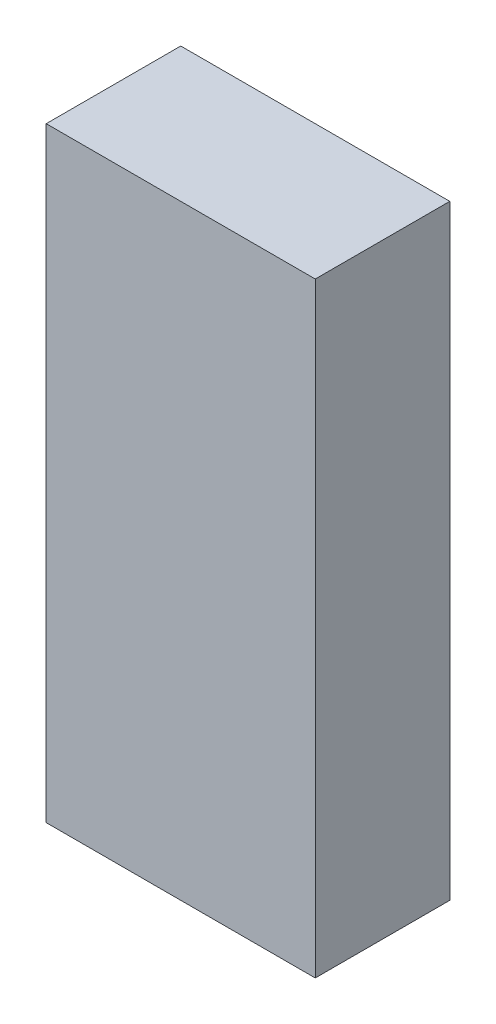
ISO-10303-21;
HEADER;
FILE_DESCRIPTION(('STEP AP214'),'2;1');
FILE_NAME('part.step','',(''),(''),'','','');
FILE_SCHEMA(('AUTOMOTIVE_DESIGN { 1 0 10303 214 1 1 1 1 }'));
ENDSEC;
DATA;
#1=APPLICATION_CONTEXT('core data for automotive mechanical design processes');
#2=APPLICATION_PROTOCOL_DEFINITION('international standard','automotive_design',2000,#1);
#3=PRODUCT_CONTEXT('',#1,'mechanical');
#4=PRODUCT('Part','Part','',(#3));
#5=PRODUCT_RELATED_PRODUCT_CATEGORY('part','',(#4));
#6=PRODUCT_DEFINITION_FORMATION('','',#4);
#7=PRODUCT_DEFINITION_CONTEXT('part definition',#1,'design');
#8=PRODUCT_DEFINITION('design','',#6,#7);
#9=PRODUCT_DEFINITION_SHAPE('','',#8);
#10=(LENGTH_UNIT() NAMED_UNIT(*) SI_UNIT(.MILLI.,.METRE.));
#11=(NAMED_UNIT(*) PLANE_ANGLE_UNIT() SI_UNIT($,.RADIAN.));
#12=(NAMED_UNIT(*) SI_UNIT($,.STERADIAN.) SOLID_ANGLE_UNIT());
#13=UNCERTAINTY_MEASURE_WITH_UNIT(LENGTH_MEASURE(1.E-05),#10,'distance_accuracy_value','');
#14=(GEOMETRIC_REPRESENTATION_CONTEXT(3) GLOBAL_UNCERTAINTY_ASSIGNED_CONTEXT((#13)) GLOBAL_UNIT_ASSIGNED_CONTEXT((#10,
#11,#12)) REPRESENTATION_CONTEXT('',''));
#15=CARTESIAN_POINT('',(0.,0.,0.));
#16=DIRECTION('',(0.,0.,1.));
#17=DIRECTION('',(1.,0.,0.));
#18=AXIS2_PLACEMENT_3D('',#15,#16,#17);
#19=CARTESIAN_POINT('',(-0.1,-2.975,0.));
#20=DIRECTION('',(1.,0.,0.));
#21=DIRECTION('',(0.,0.,1.));
#22=AXIS2_PLACEMENT_3D('',#19,#20,#21);
#23=PLANE('',#22);
#24=DIRECTION('',(0.,1.,0.));
#25=VECTOR('',#24,1.);
#26=CARTESIAN_POINT('',(-0.1,-2.975,0.1));
#27=LINE('',#26,#25);
#28=CARTESIAN_POINT('',(-0.1,-2.975,0.1));
#29=VERTEX_POINT('',#28);
#30=CARTESIAN_POINT('',(-0.1,-2.525,0.1));
#31=VERTEX_POINT('',#30);
#32=EDGE_CURVE('E11',#29,#31,#27,.T.);
#33=ORIENTED_EDGE('',*,*,#32,.T.);
#34=DIRECTION('',(0.,0.,1.));
#35=VECTOR('',#34,1.);
#36=CARTESIAN_POINT('',(-0.1,-2.525,0.));
#37=LINE('',#36,#35);
#38=CARTESIAN_POINT('',(-0.1,-2.525,0.));
#39=VERTEX_POINT('',#38);
#40=EDGE_CURVE('E24',#39,#31,#37,.T.);
#41=ORIENTED_EDGE('',*,*,#40,.F.);
#42=DIRECTION('',(0.,1.,0.));
#43=VECTOR('',#42,1.);
#44=CARTESIAN_POINT('',(-0.1,-2.975,0.));
#45=LINE('',#44,#43);
#46=CARTESIAN_POINT('',(-0.1,-2.975,0.));
#47=VERTEX_POINT('',#46);
#48=EDGE_CURVE('E86',#47,#39,#45,.T.);
#49=ORIENTED_EDGE('',*,*,#48,.F.);
#50=DIRECTION('',(0.,0.,1.));
#51=VECTOR('',#50,1.);
#52=CARTESIAN_POINT('',(-0.1,-2.975,0.));
#53=LINE('',#52,#51);
#54=EDGE_CURVE('E36',#47,#29,#53,.T.);
#55=ORIENTED_EDGE('',*,*,#54,.T.);
#56=EDGE_LOOP('',(#33,#41,#49,#55));
#57=FACE_BOUND('',#56,.T.);
#58=ADVANCED_FACE('F17',(#57),#23,.F.);
#59=CARTESIAN_POINT('',(0.1,-2.975,0.));
#60=DIRECTION('',(1.,0.,0.));
#61=DIRECTION('',(0.,0.,1.));
#62=AXIS2_PLACEMENT_3D('',#59,#60,#61);
#63=PLANE('',#62);
#64=DIRECTION('',(0.,0.,1.));
#65=VECTOR('',#64,1.);
#66=CARTESIAN_POINT('',(0.1,-2.975,0.));
#67=LINE('',#66,#65);
#68=CARTESIAN_POINT('',(0.1,-2.975,0.));
#69=VERTEX_POINT('',#68);
#70=CARTESIAN_POINT('',(0.1,-2.975,0.1));
#71=VERTEX_POINT('',#70);
#72=EDGE_CURVE('E83',#69,#71,#67,.T.);
#73=ORIENTED_EDGE('',*,*,#72,.F.);
#74=DIRECTION('',(0.,1.,0.));
#75=VECTOR('',#74,1.);
#76=CARTESIAN_POINT('',(0.1,-2.975,0.));
#77=LINE('',#76,#75);
#78=CARTESIAN_POINT('',(0.1,-2.525,0.));
#79=VERTEX_POINT('',#78);
#80=EDGE_CURVE('E63',#69,#79,#77,.T.);
#81=ORIENTED_EDGE('',*,*,#80,.T.);
#82=DIRECTION('',(0.,0.,1.));
#83=VECTOR('',#82,1.);
#84=CARTESIAN_POINT('',(0.1,-2.525,0.));
#85=LINE('',#84,#83);
#86=CARTESIAN_POINT('',(0.1,-2.525,0.1));
#87=VERTEX_POINT('',#86);
#88=EDGE_CURVE('E57',#79,#87,#85,.T.);
#89=ORIENTED_EDGE('',*,*,#88,.T.);
#90=DIRECTION('',(0.,1.,0.));
#91=VECTOR('',#90,1.);
#92=CARTESIAN_POINT('',(0.1,-2.975,0.1));
#93=LINE('',#92,#91);
#94=EDGE_CURVE('E60',#71,#87,#93,.T.);
#95=ORIENTED_EDGE('',*,*,#94,.F.);
#96=EDGE_LOOP('',(#73,#81,#89,#95));
#97=FACE_BOUND('',#96,.T.);
#98=ADVANCED_FACE('F59',(#97),#63,.T.);
#99=CARTESIAN_POINT('',(-0.1,-2.975,0.));
#100=DIRECTION('',(0.,1.,0.));
#101=DIRECTION('',(0.,0.,1.));
#102=AXIS2_PLACEMENT_3D('',#99,#100,#101);
#103=PLANE('',#102);
#104=ORIENTED_EDGE('',*,*,#72,.T.);
#105=DIRECTION('',(1.,0.,0.));
#106=VECTOR('',#105,1.);
#107=CARTESIAN_POINT('',(-0.1,-2.975,0.1));
#108=LINE('',#107,#106);
#109=EDGE_CURVE('E71',#29,#71,#108,.T.);
#110=ORIENTED_EDGE('',*,*,#109,.F.);
#111=ORIENTED_EDGE('',*,*,#54,.F.);
#112=DIRECTION('',(1.,0.,0.));
#113=VECTOR('',#112,1.);
#114=CARTESIAN_POINT('',(-0.1,-2.975,0.));
#115=LINE('',#114,#113);
#116=EDGE_CURVE('E76',#47,#69,#115,.T.);
#117=ORIENTED_EDGE('',*,*,#116,.T.);
#118=EDGE_LOOP('',(#104,#110,#111,#117));
#119=FACE_BOUND('',#118,.T.);
#120=ADVANCED_FACE('F91',(#119),#103,.F.);
#121=CARTESIAN_POINT('',(-0.1,-2.525,0.));
#122=DIRECTION('',(0.,1.,0.));
#123=DIRECTION('',(0.,0.,1.));
#124=AXIS2_PLACEMENT_3D('',#121,#122,#123);
#125=PLANE('',#124);
#126=DIRECTION('',(1.,0.,0.));
#127=VECTOR('',#126,1.);
#128=CARTESIAN_POINT('',(-0.1,-2.525,0.));
#129=LINE('',#128,#127);
#130=EDGE_CURVE('E74',#39,#79,#129,.T.);
#131=ORIENTED_EDGE('',*,*,#130,.F.);
#132=ORIENTED_EDGE('',*,*,#40,.T.);
#133=DIRECTION('',(1.,0.,0.));
#134=VECTOR('',#133,1.);
#135=CARTESIAN_POINT('',(-0.1,-2.525,0.1));
#136=LINE('',#135,#134);
#137=EDGE_CURVE('E69',#31,#87,#136,.T.);
#138=ORIENTED_EDGE('',*,*,#137,.T.);
#139=ORIENTED_EDGE('',*,*,#88,.F.);
#140=EDGE_LOOP('',(#131,#132,#138,#139));
#141=FACE_BOUND('',#140,.T.);
#142=ADVANCED_FACE('F73',(#141),#125,.T.);
#143=CARTESIAN_POINT('',(-0.1,-2.975,0.));
#144=DIRECTION('',(0.,0.,1.));
#145=DIRECTION('',(1.,0.,0.));
#146=AXIS2_PLACEMENT_3D('',#143,#144,#145);
#147=PLANE('',#146);
#148=ORIENTED_EDGE('',*,*,#130,.T.);
#149=ORIENTED_EDGE('',*,*,#80,.F.);
#150=ORIENTED_EDGE('',*,*,#116,.F.);
#151=ORIENTED_EDGE('',*,*,#48,.T.);
#152=EDGE_LOOP('',(#148,#149,#150,#151));
#153=FACE_BOUND('',#152,.T.);
#154=ADVANCED_FACE('F89',(#153),#147,.F.);
#155=CARTESIAN_POINT('',(-0.1,-2.975,0.1));
#156=DIRECTION('',(0.,0.,1.));
#157=DIRECTION('',(1.,0.,0.));
#158=AXIS2_PLACEMENT_3D('',#155,#156,#157);
#159=PLANE('',#158);
#160=ORIENTED_EDGE('',*,*,#32,.F.);
#161=ORIENTED_EDGE('',*,*,#109,.T.);
#162=ORIENTED_EDGE('',*,*,#94,.T.);
#163=ORIENTED_EDGE('',*,*,#137,.F.);
#164=EDGE_LOOP('',(#160,#161,#162,#163));
#165=FACE_BOUND('',#164,.T.);
#166=ADVANCED_FACE('F68',(#165),#159,.T.);
#167=CLOSED_SHELL('',(#58,#98,#120,#142,#154,#166));
#168=MANIFOLD_SOLID_BREP('B1',#167);
#169=ADVANCED_BREP_SHAPE_REPRESENTATION('',(#18,#168),#14);
#170=SHAPE_DEFINITION_REPRESENTATION(#9,#169);
ENDSEC;
END-ISO-10303-21;
